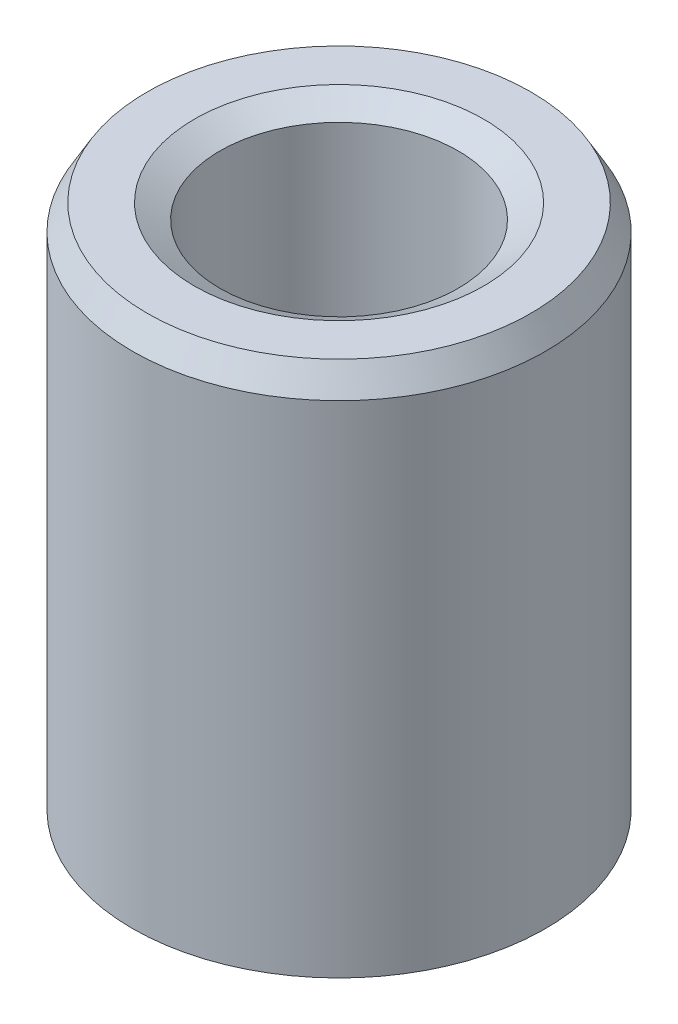
ISO-10303-21;
HEADER;
FILE_DESCRIPTION(('STEP AP214'),'2;1');
FILE_NAME('part.step','',(''),(''),'','','');
FILE_SCHEMA(('AUTOMOTIVE_DESIGN { 1 0 10303 214 1 1 1 1 }'));
ENDSEC;
DATA;
#1=APPLICATION_CONTEXT('core data for automotive mechanical design processes');
#2=APPLICATION_PROTOCOL_DEFINITION('international standard','automotive_design',2000,#1);
#3=PRODUCT_CONTEXT('',#1,'mechanical');
#4=PRODUCT('Part','Part','',(#3));
#5=PRODUCT_RELATED_PRODUCT_CATEGORY('part','',(#4));
#6=PRODUCT_DEFINITION_FORMATION('','',#4);
#7=PRODUCT_DEFINITION_CONTEXT('part definition',#1,'design');
#8=PRODUCT_DEFINITION('design','',#6,#7);
#9=PRODUCT_DEFINITION_SHAPE('','',#8);
#10=(LENGTH_UNIT() NAMED_UNIT(*) SI_UNIT(.MILLI.,.METRE.));
#11=(NAMED_UNIT(*) PLANE_ANGLE_UNIT() SI_UNIT($,.RADIAN.));
#12=(NAMED_UNIT(*) SI_UNIT($,.STERADIAN.) SOLID_ANGLE_UNIT());
#13=UNCERTAINTY_MEASURE_WITH_UNIT(LENGTH_MEASURE(1.E-05),#10,'distance_accuracy_value','');
#14=(GEOMETRIC_REPRESENTATION_CONTEXT(3) GLOBAL_UNCERTAINTY_ASSIGNED_CONTEXT((#13)) GLOBAL_UNIT_ASSIGNED_CONTEXT((#10,
#11,#12)) REPRESENTATION_CONTEXT('',''));
#15=CARTESIAN_POINT('',(0.,0.,0.));
#16=DIRECTION('',(0.,0.,1.));
#17=DIRECTION('',(1.,0.,0.));
#18=AXIS2_PLACEMENT_3D('',#15,#16,#17);
#19=CARTESIAN_POINT('',(0.,71.917842037854,0.));
#20=DIRECTION('',(0.,-1.,0.));
#21=DIRECTION('',(0.,0.,-1.));
#22=AXIS2_PLACEMENT_3D('',#19,#20,#21);
#23=CYLINDRICAL_SURFACE('',#22,27.5);
#24=CARTESIAN_POINT('',(0.,1.96149843999832,0.));
#25=DIRECTION('',(0.,1.,0.));
#26=DIRECTION('',(0.,0.,1.));
#27=AXIS2_PLACEMENT_3D('',#24,#25,#26);
#28=CIRCLE('',#27,27.5);
#29=CARTESIAN_POINT('',(0.,1.96149843999832,27.5));
#30=VERTEX_POINT('',#29);
#31=EDGE_CURVE('E10',#30,#30,#28,.T.);
#32=ORIENTED_EDGE('',*,*,#31,.T.);
#33=EDGE_LOOP('',(#32));
#34=FACE_BOUND('',#33,.T.);
#35=CARTESIAN_POINT('',(0.,68.5204270808098,0.));
#36=DIRECTION('',(0.,1.,0.));
#37=DIRECTION('',(0.,0.,1.));
#38=AXIS2_PLACEMENT_3D('',#35,#36,#37);
#39=CIRCLE('',#38,27.5);
#40=CARTESIAN_POINT('',(0.,68.5204270808098,27.5));
#41=VERTEX_POINT('',#40);
#42=EDGE_CURVE('E50',#41,#41,#39,.F.);
#43=ORIENTED_EDGE('',*,*,#42,.T.);
#44=EDGE_LOOP('',(#43));
#45=FACE_BOUND('',#44,.T.);
#46=ADVANCED_FACE('F39',(#34,#45),#23,.T.);
#47=CARTESIAN_POINT('',(0.,71.917842037854,0.));
#48=DIRECTION('',(0.,1.,0.));
#49=DIRECTION('',(0.,0.,1.));
#50=AXIS2_PLACEMENT_3D('',#47,#48,#49);
#51=PLANE('',#50);
#52=CARTESIAN_POINT('',(0.,71.917842037854,0.));
#53=DIRECTION('',(0.,1.,0.));
#54=DIRECTION('',(0.,0.,1.));
#55=AXIS2_PLACEMENT_3D('',#52,#53,#54);
#56=CIRCLE('',#55,19.2586664708532);
#57=CARTESIAN_POINT('',(0.,71.917842037854,19.2586664708532));
#58=VERTEX_POINT('',#57);
#59=EDGE_CURVE('E58',#58,#58,#56,.F.);
#60=ORIENTED_EDGE('',*,*,#59,.T.);
#61=EDGE_LOOP('',(#60));
#62=FACE_BOUND('',#61,.T.);
#63=CARTESIAN_POINT('',(0.,71.917842037854,0.));
#64=DIRECTION('',(0.,1.,0.));
#65=DIRECTION('',(0.,0.,1.));
#66=AXIS2_PLACEMENT_3D('',#63,#64,#65);
#67=CIRCLE('',#66,25.5385015600017);
#68=CARTESIAN_POINT('',(0.,71.917842037854,25.5385015600017));
#69=VERTEX_POINT('',#68);
#70=EDGE_CURVE('E61',#69,#69,#67,.T.);
#71=ORIENTED_EDGE('',*,*,#70,.T.);
#72=EDGE_LOOP('',(#71));
#73=FACE_BOUND('',#72,.T.);
#74=ADVANCED_FACE('F88',(#62,#73),#51,.T.);
#75=CARTESIAN_POINT('',(0.,0.,0.));
#76=DIRECTION('',(0.,1.,0.));
#77=DIRECTION('',(0.,0.,1.));
#78=AXIS2_PLACEMENT_3D('',#75,#76,#77);
#79=PLANE('',#78);
#80=CARTESIAN_POINT('',(0.,0.,0.));
#81=DIRECTION('',(0.,1.,0.));
#82=DIRECTION('',(0.,0.,1.));
#83=AXIS2_PLACEMENT_3D('',#80,#81,#82);
#84=CIRCLE('',#83,17.8227499538074);
#85=CARTESIAN_POINT('',(0.,0.,17.8227499538074));
#86=VERTEX_POINT('',#85);
#87=EDGE_CURVE('E51',#86,#86,#84,.T.);
#88=ORIENTED_EDGE('',*,*,#87,.T.);
#89=EDGE_LOOP('',(#88));
#90=FACE_BOUND('',#89,.T.);
#91=CARTESIAN_POINT('',(0.,0.,0.));
#92=DIRECTION('',(0.,1.,0.));
#93=DIRECTION('',(0.,0.,1.));
#94=AXIS2_PLACEMENT_3D('',#91,#92,#93);
#95=CIRCLE('',#94,24.1025850429558);
#96=CARTESIAN_POINT('',(0.,0.,24.1025850429558));
#97=VERTEX_POINT('',#96);
#98=EDGE_CURVE('E54',#97,#97,#95,.F.);
#99=ORIENTED_EDGE('',*,*,#98,.T.);
#100=EDGE_LOOP('',(#99));
#101=FACE_BOUND('',#100,.T.);
#102=ADVANCED_FACE('F83',(#90,#101),#79,.F.);
#103=CARTESIAN_POINT('',(0.,71.917842037854,0.));
#104=DIRECTION('',(0.,-1.,0.));
#105=DIRECTION('',(0.,0.,-1.));
#106=AXIS2_PLACEMENT_3D('',#103,#104,#105);
#107=CYLINDRICAL_SURFACE('',#106,15.861251513809);
#108=CARTESIAN_POINT('',(0.,69.9563435978557,0.));
#109=DIRECTION('',(0.,1.,0.));
#110=DIRECTION('',(0.,0.,1.));
#111=AXIS2_PLACEMENT_3D('',#108,#109,#110);
#112=CIRCLE('',#111,15.861251513809);
#113=CARTESIAN_POINT('',(0.,69.9563435978557,15.861251513809));
#114=VERTEX_POINT('',#113);
#115=EDGE_CURVE('E67',#114,#114,#112,.T.);
#116=ORIENTED_EDGE('',*,*,#115,.T.);
#117=EDGE_LOOP('',(#116));
#118=FACE_BOUND('',#117,.T.);
#119=CARTESIAN_POINT('',(0.,3.39741495704422,0.));
#120=DIRECTION('',(0.,1.,0.));
#121=DIRECTION('',(0.,0.,1.));
#122=AXIS2_PLACEMENT_3D('',#119,#120,#121);
#123=CIRCLE('',#122,15.861251513809);
#124=CARTESIAN_POINT('',(0.,3.39741495704422,15.861251513809));
#125=VERTEX_POINT('',#124);
#126=EDGE_CURVE('E69',#125,#125,#123,.F.);
#127=ORIENTED_EDGE('',*,*,#126,.T.);
#128=EDGE_LOOP('',(#127));
#129=FACE_BOUND('',#128,.T.);
#130=ADVANCED_FACE('F71',(#118,#129),#107,.F.);
#131=CARTESIAN_POINT('',(0.,69.9563435978557,0.));
#132=DIRECTION('',(0.,1.,0.));
#133=DIRECTION('',(0.,0.,1.));
#134=AXIS2_PLACEMENT_3D('',#131,#132,#133);
#135=CONICAL_SURFACE('',#134,15.861251513809,1.0471975511966);
#136=ORIENTED_EDGE('',*,*,#59,.F.);
#137=EDGE_LOOP('',(#136));
#138=FACE_BOUND('',#137,.T.);
#139=ORIENTED_EDGE('',*,*,#115,.F.);
#140=EDGE_LOOP('',(#139));
#141=FACE_BOUND('',#140,.T.);
#142=ADVANCED_FACE('F77',(#138,#141),#135,.F.);
#143=CARTESIAN_POINT('',(0.,0.,0.));
#144=DIRECTION('',(0.,-1.,0.));
#145=DIRECTION('',(0.,0.,-1.));
#146=AXIS2_PLACEMENT_3D('',#143,#144,#145);
#147=CONICAL_SURFACE('',#146,17.8227499538074,0.523598775598296);
#148=ORIENTED_EDGE('',*,*,#126,.F.);
#149=EDGE_LOOP('',(#148));
#150=FACE_BOUND('',#149,.T.);
#151=ORIENTED_EDGE('',*,*,#87,.F.);
#152=EDGE_LOOP('',(#151));
#153=FACE_BOUND('',#152,.T.);
#154=ADVANCED_FACE('F73',(#150,#153),#147,.F.);
#155=CARTESIAN_POINT('',(0.,1.96149843999832,0.));
#156=DIRECTION('',(0.,1.,0.));
#157=DIRECTION('',(0.,0.,1.));
#158=AXIS2_PLACEMENT_3D('',#155,#156,#157);
#159=CONICAL_SURFACE('',#158,27.5,1.0471975511966);
#160=ORIENTED_EDGE('',*,*,#98,.F.);
#161=EDGE_LOOP('',(#160));
#162=FACE_BOUND('',#161,.T.);
#163=ORIENTED_EDGE('',*,*,#31,.F.);
#164=EDGE_LOOP('',(#163));
#165=FACE_BOUND('',#164,.T.);
#166=ADVANCED_FACE('F76',(#162,#165),#159,.T.);
#167=CARTESIAN_POINT('',(0.,71.917842037854,0.));
#168=DIRECTION('',(0.,-1.,0.));
#169=DIRECTION('',(0.,0.,-1.));
#170=AXIS2_PLACEMENT_3D('',#167,#168,#169);
#171=CONICAL_SURFACE('',#170,25.5385015600017,0.523598775598296);
#172=ORIENTED_EDGE('',*,*,#42,.F.);
#173=EDGE_LOOP('',(#172));
#174=FACE_BOUND('',#173,.T.);
#175=ORIENTED_EDGE('',*,*,#70,.F.);
#176=EDGE_LOOP('',(#175));
#177=FACE_BOUND('',#176,.T.);
#178=ADVANCED_FACE('F45',(#174,#177),#171,.T.);
#179=CLOSED_SHELL('',(#46,#74,#102,#130,#142,#154,#166,#178));
#180=MANIFOLD_SOLID_BREP('B2',#179);
#181=ADVANCED_BREP_SHAPE_REPRESENTATION('',(#18,#180),#14);
#182=SHAPE_DEFINITION_REPRESENTATION(#9,#181);
ENDSEC;
END-ISO-10303-21;
